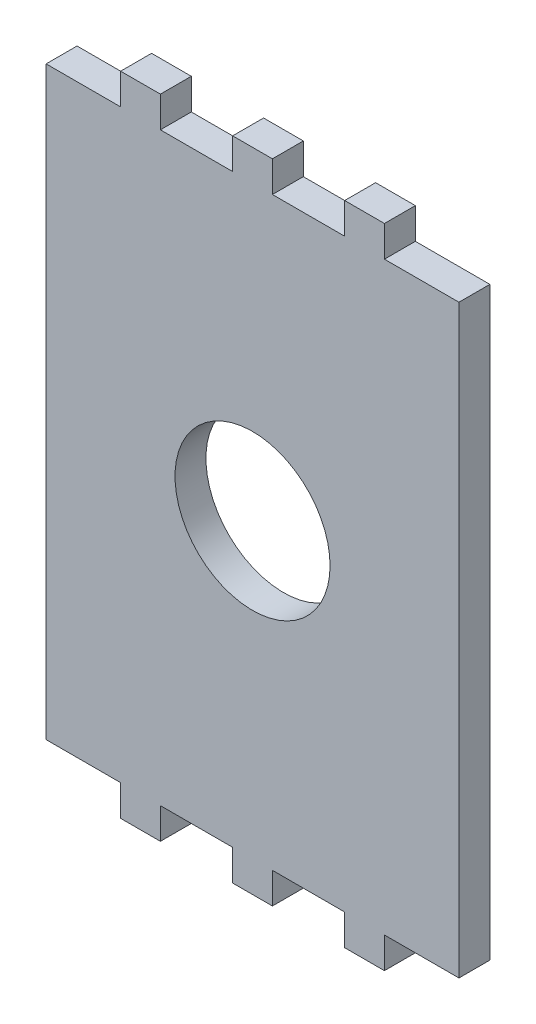
ISO-10303-21;
HEADER;
FILE_DESCRIPTION(('STEP AP214'),'2;1');
FILE_NAME('part.step','',(''),(''),'','','');
FILE_SCHEMA(('AUTOMOTIVE_DESIGN { 1 0 10303 214 1 1 1 1 }'));
ENDSEC;
DATA;
#1=APPLICATION_CONTEXT('core data for automotive mechanical design processes');
#2=APPLICATION_PROTOCOL_DEFINITION('international standard','automotive_design',2000,#1);
#3=PRODUCT_CONTEXT('',#1,'mechanical');
#4=PRODUCT('Part','Part','',(#3));
#5=PRODUCT_RELATED_PRODUCT_CATEGORY('part','',(#4));
#6=PRODUCT_DEFINITION_FORMATION('','',#4);
#7=PRODUCT_DEFINITION_CONTEXT('part definition',#1,'design');
#8=PRODUCT_DEFINITION('design','',#6,#7);
#9=PRODUCT_DEFINITION_SHAPE('','',#8);
#10=(LENGTH_UNIT() NAMED_UNIT(*) SI_UNIT(.MILLI.,.METRE.));
#11=(NAMED_UNIT(*) PLANE_ANGLE_UNIT() SI_UNIT($,.RADIAN.));
#12=(NAMED_UNIT(*) SI_UNIT($,.STERADIAN.) SOLID_ANGLE_UNIT());
#13=UNCERTAINTY_MEASURE_WITH_UNIT(LENGTH_MEASURE(1.E-05),#10,'distance_accuracy_value','');
#14=(GEOMETRIC_REPRESENTATION_CONTEXT(3) GLOBAL_UNCERTAINTY_ASSIGNED_CONTEXT((#13)) GLOBAL_UNIT_ASSIGNED_CONTEXT((#10,
#11,#12)) REPRESENTATION_CONTEXT('',''));
#15=CARTESIAN_POINT('',(0.,0.,0.));
#16=DIRECTION('',(0.,0.,1.));
#17=DIRECTION('',(1.,0.,0.));
#18=AXIS2_PLACEMENT_3D('',#15,#16,#17);
#19=CARTESIAN_POINT('',(0.,0.,0.));
#20=DIRECTION('',(0.,0.,1.));
#21=DIRECTION('',(1.,0.,0.));
#22=AXIS2_PLACEMENT_3D('',#19,#20,#21);
#23=CYLINDRICAL_SURFACE('',#22,7.95936);
#24=CARTESIAN_POINT('',(0.,0.,0.));
#25=DIRECTION('',(0.,0.,1.));
#26=DIRECTION('',(1.,0.,0.));
#27=AXIS2_PLACEMENT_3D('',#24,#25,#26);
#28=CIRCLE('',#27,7.95936);
#29=CARTESIAN_POINT('',(7.95936,0.,0.));
#30=VERTEX_POINT('',#29);
#31=EDGE_CURVE('E272',#30,#30,#28,.T.);
#32=ORIENTED_EDGE('',*,*,#31,.F.);
#33=EDGE_LOOP('',(#32));
#34=FACE_BOUND('',#33,.T.);
#35=CARTESIAN_POINT('',(0.,0.,3.175));
#36=DIRECTION('',(0.,0.,1.));
#37=DIRECTION('',(1.,0.,0.));
#38=AXIS2_PLACEMENT_3D('',#35,#36,#37);
#39=CIRCLE('',#38,7.95936);
#40=CARTESIAN_POINT('',(7.95936,0.,3.175));
#41=VERTEX_POINT('',#40);
#42=EDGE_CURVE('E474',#41,#41,#39,.T.);
#43=ORIENTED_EDGE('',*,*,#42,.T.);
#44=EDGE_LOOP('',(#43));
#45=FACE_BOUND('',#44,.T.);
#46=ADVANCED_FACE('F43',(#34,#45),#23,.F.);
#47=CARTESIAN_POINT('',(0.,0.,3.175));
#48=DIRECTION('',(0.,0.,1.));
#49=DIRECTION('',(1.,0.,0.));
#50=AXIS2_PLACEMENT_3D('',#47,#48,#49);
#51=PLANE('',#50);
#52=DIRECTION('',(1.,0.,0.));
#53=VECTOR('',#52,1.);
#54=CARTESIAN_POINT('',(13.54064,-30.04064,3.175));
#55=LINE('',#54,#53);
#56=CARTESIAN_POINT('',(13.54064,-30.04064,3.175));
#57=VERTEX_POINT('',#56);
#58=CARTESIAN_POINT('',(21.19064,-30.04064,3.175));
#59=VERTEX_POINT('',#58);
#60=EDGE_CURVE('E267',#57,#59,#55,.T.);
#61=ORIENTED_EDGE('',*,*,#60,.T.);
#62=DIRECTION('',(0.,1.,0.));
#63=VECTOR('',#62,1.);
#64=CARTESIAN_POINT('',(21.19064,-30.04064,3.175));
#65=LINE('',#64,#63);
#66=CARTESIAN_POINT('',(21.19064,30.04064,3.175));
#67=VERTEX_POINT('',#66);
#68=EDGE_CURVE('E271',#59,#67,#65,.T.);
#69=ORIENTED_EDGE('',*,*,#68,.T.);
#70=DIRECTION('',(-1.,0.,0.));
#71=VECTOR('',#70,1.);
#72=CARTESIAN_POINT('',(21.19064,30.04064,3.175));
#73=LINE('',#72,#71);
#74=CARTESIAN_POINT('',(13.54064,30.04064,3.175));
#75=VERTEX_POINT('',#74);
#76=EDGE_CURVE('E276',#67,#75,#73,.T.);
#77=ORIENTED_EDGE('',*,*,#76,.T.);
#78=DIRECTION('',(0.,1.,0.));
#79=VECTOR('',#78,1.);
#80=CARTESIAN_POINT('',(13.54064,30.04064,3.175));
#81=LINE('',#80,#79);
#82=CARTESIAN_POINT('',(13.54064,33.21564,3.175));
#83=VERTEX_POINT('',#82);
#84=EDGE_CURVE('E280',#75,#83,#81,.T.);
#85=ORIENTED_EDGE('',*,*,#84,.T.);
#86=DIRECTION('',(-1.,0.,0.));
#87=VECTOR('',#86,1.);
#88=CARTESIAN_POINT('',(13.54064,33.21564,3.175));
#89=LINE('',#88,#87);
#90=CARTESIAN_POINT('',(9.45935999999995,33.21564,3.175));
#91=VERTEX_POINT('',#90);
#92=EDGE_CURVE('E284',#83,#91,#89,.T.);
#93=ORIENTED_EDGE('',*,*,#92,.T.);
#94=DIRECTION('',(0.,-1.,0.));
#95=VECTOR('',#94,1.);
#96=CARTESIAN_POINT('',(9.45935999999995,33.21564,3.175));
#97=LINE('',#96,#95);
#98=CARTESIAN_POINT('',(9.45935999999995,30.04064,3.175));
#99=VERTEX_POINT('',#98);
#100=EDGE_CURVE('E288',#91,#99,#97,.T.);
#101=ORIENTED_EDGE('',*,*,#100,.T.);
#102=DIRECTION('',(-1.,0.,0.));
#103=VECTOR('',#102,1.);
#104=CARTESIAN_POINT('',(9.45935999999995,30.04064,3.175));
#105=LINE('',#104,#103);
#106=CARTESIAN_POINT('',(2.04063999999995,30.04064,3.175));
#107=VERTEX_POINT('',#106);
#108=EDGE_CURVE('E292',#99,#107,#105,.T.);
#109=ORIENTED_EDGE('',*,*,#108,.T.);
#110=DIRECTION('',(0.,1.,0.));
#111=VECTOR('',#110,1.);
#112=CARTESIAN_POINT('',(2.04063999999995,30.04064,3.175));
#113=LINE('',#112,#111);
#114=CARTESIAN_POINT('',(2.04063999999995,33.21564,3.175));
#115=VERTEX_POINT('',#114);
#116=EDGE_CURVE('E296',#107,#115,#113,.T.);
#117=ORIENTED_EDGE('',*,*,#116,.T.);
#118=DIRECTION('',(-1.,0.,0.));
#119=VECTOR('',#118,1.);
#120=CARTESIAN_POINT('',(2.04063999999995,33.21564,3.175));
#121=LINE('',#120,#119);
#122=CARTESIAN_POINT('',(-2.04064000000005,33.21564,3.175));
#123=VERTEX_POINT('',#122);
#124=EDGE_CURVE('E300',#115,#123,#121,.T.);
#125=ORIENTED_EDGE('',*,*,#124,.T.);
#126=DIRECTION('',(0.,-1.,0.));
#127=VECTOR('',#126,1.);
#128=CARTESIAN_POINT('',(-2.04064000000005,33.21564,3.175));
#129=LINE('',#128,#127);
#130=CARTESIAN_POINT('',(-2.04064000000005,30.04064,3.175));
#131=VERTEX_POINT('',#130);
#132=EDGE_CURVE('E304',#123,#131,#129,.T.);
#133=ORIENTED_EDGE('',*,*,#132,.T.);
#134=DIRECTION('',(-1.,0.,0.));
#135=VECTOR('',#134,1.);
#136=CARTESIAN_POINT('',(-2.04064000000005,30.04064,3.175));
#137=LINE('',#136,#135);
#138=CARTESIAN_POINT('',(-9.45936000000004,30.04064,3.175));
#139=VERTEX_POINT('',#138);
#140=EDGE_CURVE('E308',#131,#139,#137,.T.);
#141=ORIENTED_EDGE('',*,*,#140,.T.);
#142=DIRECTION('',(0.,1.,0.));
#143=VECTOR('',#142,1.);
#144=CARTESIAN_POINT('',(-9.45936000000004,30.04064,3.175));
#145=LINE('',#144,#143);
#146=CARTESIAN_POINT('',(-9.45936000000004,33.21564,3.175));
#147=VERTEX_POINT('',#146);
#148=EDGE_CURVE('E312',#139,#147,#145,.T.);
#149=ORIENTED_EDGE('',*,*,#148,.T.);
#150=DIRECTION('',(-1.,0.,0.));
#151=VECTOR('',#150,1.);
#152=CARTESIAN_POINT('',(-9.45936000000004,33.21564,3.175));
#153=LINE('',#152,#151);
#154=CARTESIAN_POINT('',(-13.5406400000001,33.21564,3.175));
#155=VERTEX_POINT('',#154);
#156=EDGE_CURVE('E316',#147,#155,#153,.T.);
#157=ORIENTED_EDGE('',*,*,#156,.T.);
#158=DIRECTION('',(0.,-1.,0.));
#159=VECTOR('',#158,1.);
#160=CARTESIAN_POINT('',(-13.5406400000001,33.21564,3.175));
#161=LINE('',#160,#159);
#162=CARTESIAN_POINT('',(-13.5406400000001,30.04064,3.175));
#163=VERTEX_POINT('',#162);
#164=EDGE_CURVE('E320',#155,#163,#161,.T.);
#165=ORIENTED_EDGE('',*,*,#164,.T.);
#166=DIRECTION('',(-1.,0.,0.));
#167=VECTOR('',#166,1.);
#168=CARTESIAN_POINT('',(-13.5406400000001,30.04064,3.175));
#169=LINE('',#168,#167);
#170=CARTESIAN_POINT('',(-21.19064,30.04064,3.175));
#171=VERTEX_POINT('',#170);
#172=EDGE_CURVE('E324',#163,#171,#169,.T.);
#173=ORIENTED_EDGE('',*,*,#172,.T.);
#174=DIRECTION('',(0.,-1.,0.));
#175=VECTOR('',#174,1.);
#176=CARTESIAN_POINT('',(-21.19064,30.04064,3.175));
#177=LINE('',#176,#175);
#178=CARTESIAN_POINT('',(-21.19064,-30.04064,3.175));
#179=VERTEX_POINT('',#178);
#180=EDGE_CURVE('E328',#171,#179,#177,.T.);
#181=ORIENTED_EDGE('',*,*,#180,.T.);
#182=DIRECTION('',(1.,0.,0.));
#183=VECTOR('',#182,1.);
#184=CARTESIAN_POINT('',(-21.19064,-30.04064,3.175));
#185=LINE('',#184,#183);
#186=CARTESIAN_POINT('',(-13.54064,-30.04064,3.175));
#187=VERTEX_POINT('',#186);
#188=EDGE_CURVE('E332',#179,#187,#185,.T.);
#189=ORIENTED_EDGE('',*,*,#188,.T.);
#190=DIRECTION('',(0.,-1.,0.));
#191=VECTOR('',#190,1.);
#192=CARTESIAN_POINT('',(-13.54064,-30.04064,3.175));
#193=LINE('',#192,#191);
#194=CARTESIAN_POINT('',(-13.54064,-33.21564,3.175));
#195=VERTEX_POINT('',#194);
#196=EDGE_CURVE('E336',#187,#195,#193,.T.);
#197=ORIENTED_EDGE('',*,*,#196,.T.);
#198=DIRECTION('',(1.,0.,0.));
#199=VECTOR('',#198,1.);
#200=CARTESIAN_POINT('',(-13.54064,-33.21564,3.175));
#201=LINE('',#200,#199);
#202=CARTESIAN_POINT('',(-9.45936000000004,-33.21564,3.175));
#203=VERTEX_POINT('',#202);
#204=EDGE_CURVE('E340',#195,#203,#201,.T.);
#205=ORIENTED_EDGE('',*,*,#204,.T.);
#206=DIRECTION('',(0.,1.,0.));
#207=VECTOR('',#206,1.);
#208=CARTESIAN_POINT('',(-9.45936000000004,-33.21564,3.175));
#209=LINE('',#208,#207);
#210=CARTESIAN_POINT('',(-9.45936000000004,-30.04064,3.175));
#211=VERTEX_POINT('',#210);
#212=EDGE_CURVE('E344',#203,#211,#209,.T.);
#213=ORIENTED_EDGE('',*,*,#212,.T.);
#214=DIRECTION('',(1.,0.,0.));
#215=VECTOR('',#214,1.);
#216=CARTESIAN_POINT('',(-9.45936000000004,-30.04064,3.175));
#217=LINE('',#216,#215);
#218=CARTESIAN_POINT('',(-2.04064000000005,-30.04064,3.175));
#219=VERTEX_POINT('',#218);
#220=EDGE_CURVE('E348',#211,#219,#217,.T.);
#221=ORIENTED_EDGE('',*,*,#220,.T.);
#222=DIRECTION('',(0.,-1.,0.));
#223=VECTOR('',#222,1.);
#224=CARTESIAN_POINT('',(-2.04064000000005,-30.04064,3.175));
#225=LINE('',#224,#223);
#226=CARTESIAN_POINT('',(-2.04064000000005,-33.21564,3.175));
#227=VERTEX_POINT('',#226);
#228=EDGE_CURVE('E352',#219,#227,#225,.T.);
#229=ORIENTED_EDGE('',*,*,#228,.T.);
#230=DIRECTION('',(1.,0.,0.));
#231=VECTOR('',#230,1.);
#232=CARTESIAN_POINT('',(-2.04064000000005,-33.21564,3.175));
#233=LINE('',#232,#231);
#234=CARTESIAN_POINT('',(2.04063999999995,-33.21564,3.175));
#235=VERTEX_POINT('',#234);
#236=EDGE_CURVE('E356',#227,#235,#233,.T.);
#237=ORIENTED_EDGE('',*,*,#236,.T.);
#238=DIRECTION('',(0.,1.,0.));
#239=VECTOR('',#238,1.);
#240=CARTESIAN_POINT('',(2.04063999999995,-33.21564,3.175));
#241=LINE('',#240,#239);
#242=CARTESIAN_POINT('',(2.04063999999995,-30.04064,3.175));
#243=VERTEX_POINT('',#242);
#244=EDGE_CURVE('E360',#235,#243,#241,.T.);
#245=ORIENTED_EDGE('',*,*,#244,.T.);
#246=DIRECTION('',(1.,0.,0.));
#247=VECTOR('',#246,1.);
#248=CARTESIAN_POINT('',(2.04063999999995,-30.04064,3.175));
#249=LINE('',#248,#247);
#250=CARTESIAN_POINT('',(9.45935999999995,-30.04064,3.175));
#251=VERTEX_POINT('',#250);
#252=EDGE_CURVE('E364',#243,#251,#249,.T.);
#253=ORIENTED_EDGE('',*,*,#252,.T.);
#254=DIRECTION('',(0.,-1.,0.));
#255=VECTOR('',#254,1.);
#256=CARTESIAN_POINT('',(9.45935999999995,-30.04064,3.175));
#257=LINE('',#256,#255);
#258=CARTESIAN_POINT('',(9.45935999999995,-33.21564,3.175));
#259=VERTEX_POINT('',#258);
#260=EDGE_CURVE('E368',#251,#259,#257,.T.);
#261=ORIENTED_EDGE('',*,*,#260,.T.);
#262=DIRECTION('',(1.,0.,0.));
#263=VECTOR('',#262,1.);
#264=CARTESIAN_POINT('',(9.45935999999995,-33.21564,3.175));
#265=LINE('',#264,#263);
#266=CARTESIAN_POINT('',(13.54064,-33.21564,3.175));
#267=VERTEX_POINT('',#266);
#268=EDGE_CURVE('E239',#259,#267,#265,.T.);
#269=ORIENTED_EDGE('',*,*,#268,.T.);
#270=DIRECTION('',(0.,1.,0.));
#271=VECTOR('',#270,1.);
#272=CARTESIAN_POINT('',(13.54064,-33.21564,3.175));
#273=LINE('',#272,#271);
#274=EDGE_CURVE('E373',#267,#57,#273,.T.);
#275=ORIENTED_EDGE('',*,*,#274,.T.);
#276=EDGE_LOOP('',(#61,#69,#77,#85,#93,#101,#109,#117,#125,#133,#141,#149,#157,#165,#173,#181,
#189,#197,#205,#213,#221,#229,#237,#245,#253,#261,#269,#275));
#277=FACE_BOUND('',#276,.T.);
#278=ORIENTED_EDGE('',*,*,#42,.F.);
#279=EDGE_LOOP('',(#278));
#280=FACE_BOUND('',#279,.T.);
#281=ADVANCED_FACE('F454',(#277,#280),#51,.T.);
#282=CARTESIAN_POINT('',(13.54064,-33.21564,0.));
#283=DIRECTION('',(1.,0.,0.));
#284=DIRECTION('',(0.,0.,-1.));
#285=AXIS2_PLACEMENT_3D('',#282,#283,#284);
#286=PLANE('',#285);
#287=ORIENTED_EDGE('',*,*,#274,.F.);
#288=DIRECTION('',(0.,0.,1.));
#289=VECTOR('',#288,1.);
#290=CARTESIAN_POINT('',(13.54064,-33.21564,0.));
#291=LINE('',#290,#289);
#292=CARTESIAN_POINT('',(13.54064,-33.21564,0.));
#293=VERTEX_POINT('',#292);
#294=EDGE_CURVE('E54',#293,#267,#291,.T.);
#295=ORIENTED_EDGE('',*,*,#294,.F.);
#296=DIRECTION('',(0.,1.,0.));
#297=VECTOR('',#296,1.);
#298=CARTESIAN_POINT('',(13.54064,-33.21564,0.));
#299=LINE('',#298,#297);
#300=CARTESIAN_POINT('',(13.54064,-30.04064,0.));
#301=VERTEX_POINT('',#300);
#302=EDGE_CURVE('E253',#293,#301,#299,.T.);
#303=ORIENTED_EDGE('',*,*,#302,.T.);
#304=DIRECTION('',(0.,0.,1.));
#305=VECTOR('',#304,1.);
#306=CARTESIAN_POINT('',(13.54064,-30.04064,0.));
#307=LINE('',#306,#305);
#308=EDGE_CURVE('E11',#301,#57,#307,.T.);
#309=ORIENTED_EDGE('',*,*,#308,.T.);
#310=EDGE_LOOP('',(#287,#295,#303,#309));
#311=FACE_BOUND('',#310,.T.);
#312=ADVANCED_FACE('F456',(#311),#286,.T.);
#313=CARTESIAN_POINT('',(9.45935999999995,-33.21564,0.));
#314=DIRECTION('',(0.,-1.,0.));
#315=DIRECTION('',(0.,0.,-1.));
#316=AXIS2_PLACEMENT_3D('',#313,#314,#315);
#317=PLANE('',#316);
#318=ORIENTED_EDGE('',*,*,#268,.F.);
#319=DIRECTION('',(0.,0.,1.));
#320=VECTOR('',#319,1.);
#321=CARTESIAN_POINT('',(9.45935999999995,-33.21564,0.));
#322=LINE('',#321,#320);
#323=CARTESIAN_POINT('',(9.45935999999995,-33.21564,0.));
#324=VERTEX_POINT('',#323);
#325=EDGE_CURVE('E234',#324,#259,#322,.T.);
#326=ORIENTED_EDGE('',*,*,#325,.F.);
#327=DIRECTION('',(1.,0.,0.));
#328=VECTOR('',#327,1.);
#329=CARTESIAN_POINT('',(9.45935999999995,-33.21564,0.));
#330=LINE('',#329,#328);
#331=EDGE_CURVE('E237',#324,#293,#330,.T.);
#332=ORIENTED_EDGE('',*,*,#331,.T.);
#333=ORIENTED_EDGE('',*,*,#294,.T.);
#334=EDGE_LOOP('',(#318,#326,#332,#333));
#335=FACE_BOUND('',#334,.T.);
#336=ADVANCED_FACE('F236',(#335),#317,.T.);
#337=CARTESIAN_POINT('',(9.45935999999995,-30.04064,0.));
#338=DIRECTION('',(-1.,0.,0.));
#339=DIRECTION('',(0.,0.,1.));
#340=AXIS2_PLACEMENT_3D('',#337,#338,#339);
#341=PLANE('',#340);
#342=ORIENTED_EDGE('',*,*,#260,.F.);
#343=DIRECTION('',(0.,0.,1.));
#344=VECTOR('',#343,1.);
#345=CARTESIAN_POINT('',(9.45935999999995,-30.04064,0.));
#346=LINE('',#345,#344);
#347=CARTESIAN_POINT('',(9.45935999999995,-30.04064,0.));
#348=VERTEX_POINT('',#347);
#349=EDGE_CURVE('E245',#348,#251,#346,.T.);
#350=ORIENTED_EDGE('',*,*,#349,.F.);
#351=DIRECTION('',(0.,-1.,0.));
#352=VECTOR('',#351,1.);
#353=CARTESIAN_POINT('',(9.45935999999995,-30.04064,0.));
#354=LINE('',#353,#352);
#355=EDGE_CURVE('E251',#348,#324,#354,.T.);
#356=ORIENTED_EDGE('',*,*,#355,.T.);
#357=ORIENTED_EDGE('',*,*,#325,.T.);
#358=EDGE_LOOP('',(#342,#350,#356,#357));
#359=FACE_BOUND('',#358,.T.);
#360=ADVANCED_FACE('F256',(#359),#341,.T.);
#361=CARTESIAN_POINT('',(2.04063999999995,-30.04064,0.));
#362=DIRECTION('',(0.,-1.,0.));
#363=DIRECTION('',(0.,0.,-1.));
#364=AXIS2_PLACEMENT_3D('',#361,#362,#363);
#365=PLANE('',#364);
#366=ORIENTED_EDGE('',*,*,#252,.F.);
#367=DIRECTION('',(0.,0.,1.));
#368=VECTOR('',#367,1.);
#369=CARTESIAN_POINT('',(2.04063999999995,-30.04064,0.));
#370=LINE('',#369,#368);
#371=CARTESIAN_POINT('',(2.04063999999995,-30.04064,0.));
#372=VERTEX_POINT('',#371);
#373=EDGE_CURVE('E382',#372,#243,#370,.T.);
#374=ORIENTED_EDGE('',*,*,#373,.F.);
#375=DIRECTION('',(1.,0.,0.));
#376=VECTOR('',#375,1.);
#377=CARTESIAN_POINT('',(2.04063999999995,-30.04064,0.));
#378=LINE('',#377,#376);
#379=EDGE_CURVE('E258',#372,#348,#378,.T.);
#380=ORIENTED_EDGE('',*,*,#379,.T.);
#381=ORIENTED_EDGE('',*,*,#349,.T.);
#382=EDGE_LOOP('',(#366,#374,#380,#381));
#383=FACE_BOUND('',#382,.T.);
#384=ADVANCED_FACE('F659',(#383),#365,.T.);
#385=CARTESIAN_POINT('',(2.04063999999995,-33.21564,0.));
#386=DIRECTION('',(1.,0.,0.));
#387=DIRECTION('',(0.,0.,-1.));
#388=AXIS2_PLACEMENT_3D('',#385,#386,#387);
#389=PLANE('',#388);
#390=ORIENTED_EDGE('',*,*,#244,.F.);
#391=DIRECTION('',(0.,0.,1.));
#392=VECTOR('',#391,1.);
#393=CARTESIAN_POINT('',(2.04063999999995,-33.21564,0.));
#394=LINE('',#393,#392);
#395=CARTESIAN_POINT('',(2.04063999999995,-33.21564,0.));
#396=VERTEX_POINT('',#395);
#397=EDGE_CURVE('E385',#396,#235,#394,.T.);
#398=ORIENTED_EDGE('',*,*,#397,.F.);
#399=DIRECTION('',(0.,1.,0.));
#400=VECTOR('',#399,1.);
#401=CARTESIAN_POINT('',(2.04063999999995,-33.21564,0.));
#402=LINE('',#401,#400);
#403=EDGE_CURVE('E261',#396,#372,#402,.T.);
#404=ORIENTED_EDGE('',*,*,#403,.T.);
#405=ORIENTED_EDGE('',*,*,#373,.T.);
#406=EDGE_LOOP('',(#390,#398,#404,#405));
#407=FACE_BOUND('',#406,.T.);
#408=ADVANCED_FACE('F573',(#407),#389,.T.);
#409=CARTESIAN_POINT('',(-2.04064000000005,-33.21564,0.));
#410=DIRECTION('',(0.,-1.,0.));
#411=DIRECTION('',(0.,0.,-1.));
#412=AXIS2_PLACEMENT_3D('',#409,#410,#411);
#413=PLANE('',#412);
#414=ORIENTED_EDGE('',*,*,#236,.F.);
#415=DIRECTION('',(0.,0.,1.));
#416=VECTOR('',#415,1.);
#417=CARTESIAN_POINT('',(-2.04064000000005,-33.21564,0.));
#418=LINE('',#417,#416);
#419=CARTESIAN_POINT('',(-2.04064000000005,-33.21564,0.));
#420=VERTEX_POINT('',#419);
#421=EDGE_CURVE('E388',#420,#227,#418,.T.);
#422=ORIENTED_EDGE('',*,*,#421,.F.);
#423=DIRECTION('',(1.,0.,0.));
#424=VECTOR('',#423,1.);
#425=CARTESIAN_POINT('',(-2.04064000000005,-33.21564,0.));
#426=LINE('',#425,#424);
#427=EDGE_CURVE('E565',#420,#396,#426,.T.);
#428=ORIENTED_EDGE('',*,*,#427,.T.);
#429=ORIENTED_EDGE('',*,*,#397,.T.);
#430=EDGE_LOOP('',(#414,#422,#428,#429));
#431=FACE_BOUND('',#430,.T.);
#432=ADVANCED_FACE('F579',(#431),#413,.T.);
#433=CARTESIAN_POINT('',(-2.04064000000005,-30.04064,0.));
#434=DIRECTION('',(-1.,0.,0.));
#435=DIRECTION('',(0.,0.,1.));
#436=AXIS2_PLACEMENT_3D('',#433,#434,#435);
#437=PLANE('',#436);
#438=ORIENTED_EDGE('',*,*,#228,.F.);
#439=DIRECTION('',(0.,0.,1.));
#440=VECTOR('',#439,1.);
#441=CARTESIAN_POINT('',(-2.04064000000005,-30.04064,0.));
#442=LINE('',#441,#440);
#443=CARTESIAN_POINT('',(-2.04064000000005,-30.04064,0.));
#444=VERTEX_POINT('',#443);
#445=EDGE_CURVE('E391',#444,#219,#442,.T.);
#446=ORIENTED_EDGE('',*,*,#445,.F.);
#447=DIRECTION('',(0.,-1.,0.));
#448=VECTOR('',#447,1.);
#449=CARTESIAN_POINT('',(-2.04064000000005,-30.04064,0.));
#450=LINE('',#449,#448);
#451=EDGE_CURVE('E561',#444,#420,#450,.T.);
#452=ORIENTED_EDGE('',*,*,#451,.T.);
#453=ORIENTED_EDGE('',*,*,#421,.T.);
#454=EDGE_LOOP('',(#438,#446,#452,#453));
#455=FACE_BOUND('',#454,.T.);
#456=ADVANCED_FACE('F582',(#455),#437,.T.);
#457=CARTESIAN_POINT('',(-9.45936000000004,-30.04064,0.));
#458=DIRECTION('',(0.,-1.,0.));
#459=DIRECTION('',(0.,0.,-1.));
#460=AXIS2_PLACEMENT_3D('',#457,#458,#459);
#461=PLANE('',#460);
#462=ORIENTED_EDGE('',*,*,#220,.F.);
#463=DIRECTION('',(0.,0.,1.));
#464=VECTOR('',#463,1.);
#465=CARTESIAN_POINT('',(-9.45936000000004,-30.04064,0.));
#466=LINE('',#465,#464);
#467=CARTESIAN_POINT('',(-9.45936000000004,-30.04064,0.));
#468=VERTEX_POINT('',#467);
#469=EDGE_CURVE('E394',#468,#211,#466,.T.);
#470=ORIENTED_EDGE('',*,*,#469,.F.);
#471=DIRECTION('',(1.,0.,0.));
#472=VECTOR('',#471,1.);
#473=CARTESIAN_POINT('',(-9.45936000000004,-30.04064,0.));
#474=LINE('',#473,#472);
#475=EDGE_CURVE('E557',#468,#444,#474,.T.);
#476=ORIENTED_EDGE('',*,*,#475,.T.);
#477=ORIENTED_EDGE('',*,*,#445,.T.);
#478=EDGE_LOOP('',(#462,#470,#476,#477));
#479=FACE_BOUND('',#478,.T.);
#480=ADVANCED_FACE('F587',(#479),#461,.T.);
#481=CARTESIAN_POINT('',(-9.45936000000004,-33.21564,0.));
#482=DIRECTION('',(1.,0.,0.));
#483=DIRECTION('',(0.,0.,-1.));
#484=AXIS2_PLACEMENT_3D('',#481,#482,#483);
#485=PLANE('',#484);
#486=ORIENTED_EDGE('',*,*,#212,.F.);
#487=DIRECTION('',(0.,0.,1.));
#488=VECTOR('',#487,1.);
#489=CARTESIAN_POINT('',(-9.45936000000004,-33.21564,0.));
#490=LINE('',#489,#488);
#491=CARTESIAN_POINT('',(-9.45936000000004,-33.21564,0.));
#492=VERTEX_POINT('',#491);
#493=EDGE_CURVE('E397',#492,#203,#490,.T.);
#494=ORIENTED_EDGE('',*,*,#493,.F.);
#495=DIRECTION('',(0.,1.,0.));
#496=VECTOR('',#495,1.);
#497=CARTESIAN_POINT('',(-9.45936000000004,-33.21564,0.));
#498=LINE('',#497,#496);
#499=EDGE_CURVE('E553',#492,#468,#498,.T.);
#500=ORIENTED_EDGE('',*,*,#499,.T.);
#501=ORIENTED_EDGE('',*,*,#469,.T.);
#502=EDGE_LOOP('',(#486,#494,#500,#501));
#503=FACE_BOUND('',#502,.T.);
#504=ADVANCED_FACE('F590',(#503),#485,.T.);
#505=CARTESIAN_POINT('',(-13.54064,-33.21564,0.));
#506=DIRECTION('',(0.,-1.,0.));
#507=DIRECTION('',(0.,0.,-1.));
#508=AXIS2_PLACEMENT_3D('',#505,#506,#507);
#509=PLANE('',#508);
#510=ORIENTED_EDGE('',*,*,#204,.F.);
#511=DIRECTION('',(0.,0.,1.));
#512=VECTOR('',#511,1.);
#513=CARTESIAN_POINT('',(-13.54064,-33.21564,0.));
#514=LINE('',#513,#512);
#515=CARTESIAN_POINT('',(-13.54064,-33.21564,0.));
#516=VERTEX_POINT('',#515);
#517=EDGE_CURVE('E400',#516,#195,#514,.T.);
#518=ORIENTED_EDGE('',*,*,#517,.F.);
#519=DIRECTION('',(1.,0.,0.));
#520=VECTOR('',#519,1.);
#521=CARTESIAN_POINT('',(-13.54064,-33.21564,0.));
#522=LINE('',#521,#520);
#523=EDGE_CURVE('E549',#516,#492,#522,.T.);
#524=ORIENTED_EDGE('',*,*,#523,.T.);
#525=ORIENTED_EDGE('',*,*,#493,.T.);
#526=EDGE_LOOP('',(#510,#518,#524,#525));
#527=FACE_BOUND('',#526,.T.);
#528=ADVANCED_FACE('F595',(#527),#509,.T.);
#529=CARTESIAN_POINT('',(-13.54064,-30.04064,0.));
#530=DIRECTION('',(-1.,0.,0.));
#531=DIRECTION('',(0.,-1.,0.));
#532=AXIS2_PLACEMENT_3D('',#529,#530,#531);
#533=PLANE('',#532);
#534=ORIENTED_EDGE('',*,*,#196,.F.);
#535=DIRECTION('',(0.,0.,1.));
#536=VECTOR('',#535,1.);
#537=CARTESIAN_POINT('',(-13.54064,-30.04064,0.));
#538=LINE('',#537,#536);
#539=CARTESIAN_POINT('',(-13.54064,-30.04064,0.));
#540=VERTEX_POINT('',#539);
#541=EDGE_CURVE('E403',#540,#187,#538,.T.);
#542=ORIENTED_EDGE('',*,*,#541,.F.);
#543=DIRECTION('',(0.,-1.,0.));
#544=VECTOR('',#543,1.);
#545=CARTESIAN_POINT('',(-13.54064,-30.04064,0.));
#546=LINE('',#545,#544);
#547=EDGE_CURVE('E545',#540,#516,#546,.T.);
#548=ORIENTED_EDGE('',*,*,#547,.T.);
#549=ORIENTED_EDGE('',*,*,#517,.T.);
#550=EDGE_LOOP('',(#534,#542,#548,#549));
#551=FACE_BOUND('',#550,.T.);
#552=ADVANCED_FACE('F598',(#551),#533,.T.);
#553=CARTESIAN_POINT('',(-21.19064,-30.04064,0.));
#554=DIRECTION('',(0.,-1.,0.));
#555=DIRECTION('',(0.,0.,-1.));
#556=AXIS2_PLACEMENT_3D('',#553,#554,#555);
#557=PLANE('',#556);
#558=ORIENTED_EDGE('',*,*,#188,.F.);
#559=DIRECTION('',(0.,0.,1.));
#560=VECTOR('',#559,1.);
#561=CARTESIAN_POINT('',(-21.19064,-30.04064,0.));
#562=LINE('',#561,#560);
#563=CARTESIAN_POINT('',(-21.19064,-30.04064,0.));
#564=VERTEX_POINT('',#563);
#565=EDGE_CURVE('E406',#564,#179,#562,.T.);
#566=ORIENTED_EDGE('',*,*,#565,.F.);
#567=DIRECTION('',(1.,0.,0.));
#568=VECTOR('',#567,1.);
#569=CARTESIAN_POINT('',(-21.19064,-30.04064,0.));
#570=LINE('',#569,#568);
#571=EDGE_CURVE('E541',#564,#540,#570,.T.);
#572=ORIENTED_EDGE('',*,*,#571,.T.);
#573=ORIENTED_EDGE('',*,*,#541,.T.);
#574=EDGE_LOOP('',(#558,#566,#572,#573));
#575=FACE_BOUND('',#574,.T.);
#576=ADVANCED_FACE('F603',(#575),#557,.T.);
#577=CARTESIAN_POINT('',(-21.19064,30.04064,0.));
#578=DIRECTION('',(-1.,0.,0.));
#579=DIRECTION('',(0.,0.,1.));
#580=AXIS2_PLACEMENT_3D('',#577,#578,#579);
#581=PLANE('',#580);
#582=ORIENTED_EDGE('',*,*,#180,.F.);
#583=DIRECTION('',(0.,0.,1.));
#584=VECTOR('',#583,1.);
#585=CARTESIAN_POINT('',(-21.19064,30.04064,0.));
#586=LINE('',#585,#584);
#587=CARTESIAN_POINT('',(-21.19064,30.04064,0.));
#588=VERTEX_POINT('',#587);
#589=EDGE_CURVE('E409',#588,#171,#586,.T.);
#590=ORIENTED_EDGE('',*,*,#589,.F.);
#591=DIRECTION('',(0.,-1.,0.));
#592=VECTOR('',#591,1.);
#593=CARTESIAN_POINT('',(-21.19064,30.04064,0.));
#594=LINE('',#593,#592);
#595=EDGE_CURVE('E537',#588,#564,#594,.T.);
#596=ORIENTED_EDGE('',*,*,#595,.T.);
#597=ORIENTED_EDGE('',*,*,#565,.T.);
#598=EDGE_LOOP('',(#582,#590,#596,#597));
#599=FACE_BOUND('',#598,.T.);
#600=ADVANCED_FACE('F606',(#599),#581,.T.);
#601=CARTESIAN_POINT('',(-13.5406400000001,30.04064,0.));
#602=DIRECTION('',(0.,1.,0.));
#603=DIRECTION('',(0.,0.,1.));
#604=AXIS2_PLACEMENT_3D('',#601,#602,#603);
#605=PLANE('',#604);
#606=ORIENTED_EDGE('',*,*,#172,.F.);
#607=DIRECTION('',(0.,0.,1.));
#608=VECTOR('',#607,1.);
#609=CARTESIAN_POINT('',(-13.5406400000001,30.04064,0.));
#610=LINE('',#609,#608);
#611=CARTESIAN_POINT('',(-13.5406400000001,30.04064,0.));
#612=VERTEX_POINT('',#611);
#613=EDGE_CURVE('E412',#612,#163,#610,.T.);
#614=ORIENTED_EDGE('',*,*,#613,.F.);
#615=DIRECTION('',(-1.,0.,0.));
#616=VECTOR('',#615,1.);
#617=CARTESIAN_POINT('',(-13.5406400000001,30.04064,0.));
#618=LINE('',#617,#616);
#619=EDGE_CURVE('E533',#612,#588,#618,.T.);
#620=ORIENTED_EDGE('',*,*,#619,.T.);
#621=ORIENTED_EDGE('',*,*,#589,.T.);
#622=EDGE_LOOP('',(#606,#614,#620,#621));
#623=FACE_BOUND('',#622,.T.);
#624=ADVANCED_FACE('F611',(#623),#605,.T.);
#625=CARTESIAN_POINT('',(-13.5406400000001,33.21564,0.));
#626=DIRECTION('',(-1.,0.,0.));
#627=DIRECTION('',(0.,-1.,0.));
#628=AXIS2_PLACEMENT_3D('',#625,#626,#627);
#629=PLANE('',#628);
#630=ORIENTED_EDGE('',*,*,#164,.F.);
#631=DIRECTION('',(0.,0.,1.));
#632=VECTOR('',#631,1.);
#633=CARTESIAN_POINT('',(-13.5406400000001,33.21564,0.));
#634=LINE('',#633,#632);
#635=CARTESIAN_POINT('',(-13.5406400000001,33.21564,0.));
#636=VERTEX_POINT('',#635);
#637=EDGE_CURVE('E415',#636,#155,#634,.T.);
#638=ORIENTED_EDGE('',*,*,#637,.F.);
#639=DIRECTION('',(0.,-1.,0.));
#640=VECTOR('',#639,1.);
#641=CARTESIAN_POINT('',(-13.5406400000001,33.21564,0.));
#642=LINE('',#641,#640);
#643=EDGE_CURVE('E529',#636,#612,#642,.T.);
#644=ORIENTED_EDGE('',*,*,#643,.T.);
#645=ORIENTED_EDGE('',*,*,#613,.T.);
#646=EDGE_LOOP('',(#630,#638,#644,#645));
#647=FACE_BOUND('',#646,.T.);
#648=ADVANCED_FACE('F614',(#647),#629,.T.);
#649=CARTESIAN_POINT('',(-9.45936000000004,33.21564,0.));
#650=DIRECTION('',(0.,1.,0.));
#651=DIRECTION('',(-1.,0.,0.));
#652=AXIS2_PLACEMENT_3D('',#649,#650,#651);
#653=PLANE('',#652);
#654=ORIENTED_EDGE('',*,*,#156,.F.);
#655=DIRECTION('',(0.,0.,1.));
#656=VECTOR('',#655,1.);
#657=CARTESIAN_POINT('',(-9.45936000000004,33.21564,0.));
#658=LINE('',#657,#656);
#659=CARTESIAN_POINT('',(-9.45936000000004,33.21564,0.));
#660=VERTEX_POINT('',#659);
#661=EDGE_CURVE('E418',#660,#147,#658,.T.);
#662=ORIENTED_EDGE('',*,*,#661,.F.);
#663=DIRECTION('',(-1.,0.,0.));
#664=VECTOR('',#663,1.);
#665=CARTESIAN_POINT('',(-9.45936000000004,33.21564,0.));
#666=LINE('',#665,#664);
#667=EDGE_CURVE('E525',#660,#636,#666,.T.);
#668=ORIENTED_EDGE('',*,*,#667,.T.);
#669=ORIENTED_EDGE('',*,*,#637,.T.);
#670=EDGE_LOOP('',(#654,#662,#668,#669));
#671=FACE_BOUND('',#670,.T.);
#672=ADVANCED_FACE('F619',(#671),#653,.T.);
#673=CARTESIAN_POINT('',(-9.45936000000004,30.04064,0.));
#674=DIRECTION('',(1.,0.,0.));
#675=DIRECTION('',(0.,0.,-1.));
#676=AXIS2_PLACEMENT_3D('',#673,#674,#675);
#677=PLANE('',#676);
#678=ORIENTED_EDGE('',*,*,#148,.F.);
#679=DIRECTION('',(0.,0.,1.));
#680=VECTOR('',#679,1.);
#681=CARTESIAN_POINT('',(-9.45936000000004,30.04064,0.));
#682=LINE('',#681,#680);
#683=CARTESIAN_POINT('',(-9.45936000000004,30.04064,0.));
#684=VERTEX_POINT('',#683);
#685=EDGE_CURVE('E421',#684,#139,#682,.T.);
#686=ORIENTED_EDGE('',*,*,#685,.F.);
#687=DIRECTION('',(0.,1.,0.));
#688=VECTOR('',#687,1.);
#689=CARTESIAN_POINT('',(-9.45936000000004,30.04064,0.));
#690=LINE('',#689,#688);
#691=EDGE_CURVE('E521',#684,#660,#690,.T.);
#692=ORIENTED_EDGE('',*,*,#691,.T.);
#693=ORIENTED_EDGE('',*,*,#661,.T.);
#694=EDGE_LOOP('',(#678,#686,#692,#693));
#695=FACE_BOUND('',#694,.T.);
#696=ADVANCED_FACE('F622',(#695),#677,.T.);
#697=CARTESIAN_POINT('',(-2.04064000000005,30.04064,0.));
#698=DIRECTION('',(0.,1.,0.));
#699=DIRECTION('',(0.,0.,1.));
#700=AXIS2_PLACEMENT_3D('',#697,#698,#699);
#701=PLANE('',#700);
#702=ORIENTED_EDGE('',*,*,#140,.F.);
#703=DIRECTION('',(0.,0.,1.));
#704=VECTOR('',#703,1.);
#705=CARTESIAN_POINT('',(-2.04064000000005,30.04064,0.));
#706=LINE('',#705,#704);
#707=CARTESIAN_POINT('',(-2.04064000000005,30.04064,0.));
#708=VERTEX_POINT('',#707);
#709=EDGE_CURVE('E424',#708,#131,#706,.T.);
#710=ORIENTED_EDGE('',*,*,#709,.F.);
#711=DIRECTION('',(-1.,0.,0.));
#712=VECTOR('',#711,1.);
#713=CARTESIAN_POINT('',(-2.04064000000005,30.04064,0.));
#714=LINE('',#713,#712);
#715=EDGE_CURVE('E517',#708,#684,#714,.T.);
#716=ORIENTED_EDGE('',*,*,#715,.T.);
#717=ORIENTED_EDGE('',*,*,#685,.T.);
#718=EDGE_LOOP('',(#702,#710,#716,#717));
#719=FACE_BOUND('',#718,.T.);
#720=ADVANCED_FACE('F627',(#719),#701,.T.);
#721=CARTESIAN_POINT('',(-2.04064000000005,33.21564,0.));
#722=DIRECTION('',(-1.,0.,0.));
#723=DIRECTION('',(0.,0.,1.));
#724=AXIS2_PLACEMENT_3D('',#721,#722,#723);
#725=PLANE('',#724);
#726=ORIENTED_EDGE('',*,*,#132,.F.);
#727=DIRECTION('',(0.,0.,1.));
#728=VECTOR('',#727,1.);
#729=CARTESIAN_POINT('',(-2.04064000000005,33.21564,0.));
#730=LINE('',#729,#728);
#731=CARTESIAN_POINT('',(-2.04064000000005,33.21564,0.));
#732=VERTEX_POINT('',#731);
#733=EDGE_CURVE('E427',#732,#123,#730,.T.);
#734=ORIENTED_EDGE('',*,*,#733,.F.);
#735=DIRECTION('',(0.,-1.,0.));
#736=VECTOR('',#735,1.);
#737=CARTESIAN_POINT('',(-2.04064000000005,33.21564,0.));
#738=LINE('',#737,#736);
#739=EDGE_CURVE('E513',#732,#708,#738,.T.);
#740=ORIENTED_EDGE('',*,*,#739,.T.);
#741=ORIENTED_EDGE('',*,*,#709,.T.);
#742=EDGE_LOOP('',(#726,#734,#740,#741));
#743=FACE_BOUND('',#742,.T.);
#744=ADVANCED_FACE('F630',(#743),#725,.T.);
#745=CARTESIAN_POINT('',(2.04063999999995,33.21564,0.));
#746=DIRECTION('',(0.,1.,0.));
#747=DIRECTION('',(0.,0.,1.));
#748=AXIS2_PLACEMENT_3D('',#745,#746,#747);
#749=PLANE('',#748);
#750=ORIENTED_EDGE('',*,*,#124,.F.);
#751=DIRECTION('',(0.,0.,1.));
#752=VECTOR('',#751,1.);
#753=CARTESIAN_POINT('',(2.04063999999995,33.21564,0.));
#754=LINE('',#753,#752);
#755=CARTESIAN_POINT('',(2.04063999999995,33.21564,0.));
#756=VERTEX_POINT('',#755);
#757=EDGE_CURVE('E430',#756,#115,#754,.T.);
#758=ORIENTED_EDGE('',*,*,#757,.F.);
#759=DIRECTION('',(-1.,0.,0.));
#760=VECTOR('',#759,1.);
#761=CARTESIAN_POINT('',(2.04063999999995,33.21564,0.));
#762=LINE('',#761,#760);
#763=EDGE_CURVE('E509',#756,#732,#762,.T.);
#764=ORIENTED_EDGE('',*,*,#763,.T.);
#765=ORIENTED_EDGE('',*,*,#733,.T.);
#766=EDGE_LOOP('',(#750,#758,#764,#765));
#767=FACE_BOUND('',#766,.T.);
#768=ADVANCED_FACE('F635',(#767),#749,.T.);
#769=CARTESIAN_POINT('',(2.04063999999995,30.04064,0.));
#770=DIRECTION('',(1.,0.,0.));
#771=DIRECTION('',(0.,0.,-1.));
#772=AXIS2_PLACEMENT_3D('',#769,#770,#771);
#773=PLANE('',#772);
#774=ORIENTED_EDGE('',*,*,#116,.F.);
#775=DIRECTION('',(0.,0.,1.));
#776=VECTOR('',#775,1.);
#777=CARTESIAN_POINT('',(2.04063999999995,30.04064,0.));
#778=LINE('',#777,#776);
#779=CARTESIAN_POINT('',(2.04063999999995,30.04064,0.));
#780=VERTEX_POINT('',#779);
#781=EDGE_CURVE('E433',#780,#107,#778,.T.);
#782=ORIENTED_EDGE('',*,*,#781,.F.);
#783=DIRECTION('',(0.,1.,0.));
#784=VECTOR('',#783,1.);
#785=CARTESIAN_POINT('',(2.04063999999995,30.04064,0.));
#786=LINE('',#785,#784);
#787=EDGE_CURVE('E505',#780,#756,#786,.T.);
#788=ORIENTED_EDGE('',*,*,#787,.T.);
#789=ORIENTED_EDGE('',*,*,#757,.T.);
#790=EDGE_LOOP('',(#774,#782,#788,#789));
#791=FACE_BOUND('',#790,.T.);
#792=ADVANCED_FACE('F638',(#791),#773,.T.);
#793=CARTESIAN_POINT('',(9.45935999999995,30.04064,0.));
#794=DIRECTION('',(0.,1.,0.));
#795=DIRECTION('',(0.,0.,1.));
#796=AXIS2_PLACEMENT_3D('',#793,#794,#795);
#797=PLANE('',#796);
#798=ORIENTED_EDGE('',*,*,#108,.F.);
#799=DIRECTION('',(0.,0.,1.));
#800=VECTOR('',#799,1.);
#801=CARTESIAN_POINT('',(9.45935999999995,30.04064,0.));
#802=LINE('',#801,#800);
#803=CARTESIAN_POINT('',(9.45935999999995,30.04064,0.));
#804=VERTEX_POINT('',#803);
#805=EDGE_CURVE('E436',#804,#99,#802,.T.);
#806=ORIENTED_EDGE('',*,*,#805,.F.);
#807=DIRECTION('',(-1.,0.,0.));
#808=VECTOR('',#807,1.);
#809=CARTESIAN_POINT('',(9.45935999999995,30.04064,0.));
#810=LINE('',#809,#808);
#811=EDGE_CURVE('E501',#804,#780,#810,.T.);
#812=ORIENTED_EDGE('',*,*,#811,.T.);
#813=ORIENTED_EDGE('',*,*,#781,.T.);
#814=EDGE_LOOP('',(#798,#806,#812,#813));
#815=FACE_BOUND('',#814,.T.);
#816=ADVANCED_FACE('F643',(#815),#797,.T.);
#817=CARTESIAN_POINT('',(9.45935999999995,33.21564,0.));
#818=DIRECTION('',(-1.,0.,0.));
#819=DIRECTION('',(0.,0.,1.));
#820=AXIS2_PLACEMENT_3D('',#817,#818,#819);
#821=PLANE('',#820);
#822=ORIENTED_EDGE('',*,*,#100,.F.);
#823=DIRECTION('',(0.,0.,1.));
#824=VECTOR('',#823,1.);
#825=CARTESIAN_POINT('',(9.45935999999995,33.21564,0.));
#826=LINE('',#825,#824);
#827=CARTESIAN_POINT('',(9.45935999999995,33.21564,0.));
#828=VERTEX_POINT('',#827);
#829=EDGE_CURVE('E439',#828,#91,#826,.T.);
#830=ORIENTED_EDGE('',*,*,#829,.F.);
#831=DIRECTION('',(0.,-1.,0.));
#832=VECTOR('',#831,1.);
#833=CARTESIAN_POINT('',(9.45935999999995,33.21564,0.));
#834=LINE('',#833,#832);
#835=EDGE_CURVE('E497',#828,#804,#834,.T.);
#836=ORIENTED_EDGE('',*,*,#835,.T.);
#837=ORIENTED_EDGE('',*,*,#805,.T.);
#838=EDGE_LOOP('',(#822,#830,#836,#837));
#839=FACE_BOUND('',#838,.T.);
#840=ADVANCED_FACE('F646',(#839),#821,.T.);
#841=CARTESIAN_POINT('',(13.54064,33.21564,0.));
#842=DIRECTION('',(0.,1.,0.));
#843=DIRECTION('',(0.,0.,1.));
#844=AXIS2_PLACEMENT_3D('',#841,#842,#843);
#845=PLANE('',#844);
#846=ORIENTED_EDGE('',*,*,#92,.F.);
#847=DIRECTION('',(0.,0.,1.));
#848=VECTOR('',#847,1.);
#849=CARTESIAN_POINT('',(13.54064,33.21564,0.));
#850=LINE('',#849,#848);
#851=CARTESIAN_POINT('',(13.54064,33.21564,0.));
#852=VERTEX_POINT('',#851);
#853=EDGE_CURVE('E442',#852,#83,#850,.T.);
#854=ORIENTED_EDGE('',*,*,#853,.F.);
#855=DIRECTION('',(-1.,0.,0.));
#856=VECTOR('',#855,1.);
#857=CARTESIAN_POINT('',(13.54064,33.21564,0.));
#858=LINE('',#857,#856);
#859=EDGE_CURVE('E493',#852,#828,#858,.T.);
#860=ORIENTED_EDGE('',*,*,#859,.T.);
#861=ORIENTED_EDGE('',*,*,#829,.T.);
#862=EDGE_LOOP('',(#846,#854,#860,#861));
#863=FACE_BOUND('',#862,.T.);
#864=ADVANCED_FACE('F651',(#863),#845,.T.);
#865=CARTESIAN_POINT('',(13.54064,30.04064,0.));
#866=DIRECTION('',(1.,0.,0.));
#867=DIRECTION('',(0.,0.,-1.));
#868=AXIS2_PLACEMENT_3D('',#865,#866,#867);
#869=PLANE('',#868);
#870=ORIENTED_EDGE('',*,*,#84,.F.);
#871=DIRECTION('',(0.,0.,1.));
#872=VECTOR('',#871,1.);
#873=CARTESIAN_POINT('',(13.54064,30.04064,0.));
#874=LINE('',#873,#872);
#875=CARTESIAN_POINT('',(13.54064,30.04064,0.));
#876=VERTEX_POINT('',#875);
#877=EDGE_CURVE('E445',#876,#75,#874,.T.);
#878=ORIENTED_EDGE('',*,*,#877,.F.);
#879=DIRECTION('',(0.,1.,0.));
#880=VECTOR('',#879,1.);
#881=CARTESIAN_POINT('',(13.54064,30.04064,0.));
#882=LINE('',#881,#880);
#883=EDGE_CURVE('E489',#876,#852,#882,.T.);
#884=ORIENTED_EDGE('',*,*,#883,.T.);
#885=ORIENTED_EDGE('',*,*,#853,.T.);
#886=EDGE_LOOP('',(#870,#878,#884,#885));
#887=FACE_BOUND('',#886,.T.);
#888=ADVANCED_FACE('F654',(#887),#869,.T.);
#889=CARTESIAN_POINT('',(21.19064,30.04064,0.));
#890=DIRECTION('',(0.,1.,0.));
#891=DIRECTION('',(0.,0.,1.));
#892=AXIS2_PLACEMENT_3D('',#889,#890,#891);
#893=PLANE('',#892);
#894=ORIENTED_EDGE('',*,*,#76,.F.);
#895=DIRECTION('',(0.,0.,1.));
#896=VECTOR('',#895,1.);
#897=CARTESIAN_POINT('',(21.19064,30.04064,0.));
#898=LINE('',#897,#896);
#899=CARTESIAN_POINT('',(21.19064,30.04064,0.));
#900=VERTEX_POINT('',#899);
#901=EDGE_CURVE('E447',#900,#67,#898,.T.);
#902=ORIENTED_EDGE('',*,*,#901,.F.);
#903=DIRECTION('',(-1.,0.,0.));
#904=VECTOR('',#903,1.);
#905=CARTESIAN_POINT('',(21.19064,30.04064,0.));
#906=LINE('',#905,#904);
#907=EDGE_CURVE('E485',#900,#876,#906,.T.);
#908=ORIENTED_EDGE('',*,*,#907,.T.);
#909=ORIENTED_EDGE('',*,*,#877,.T.);
#910=EDGE_LOOP('',(#894,#902,#908,#909));
#911=FACE_BOUND('',#910,.T.);
#912=ADVANCED_FACE('F657',(#911),#893,.T.);
#913=CARTESIAN_POINT('',(21.19064,-30.04064,0.));
#914=DIRECTION('',(1.,0.,0.));
#915=DIRECTION('',(0.,0.,-1.));
#916=AXIS2_PLACEMENT_3D('',#913,#914,#915);
#917=PLANE('',#916);
#918=ORIENTED_EDGE('',*,*,#68,.F.);
#919=DIRECTION('',(0.,0.,1.));
#920=VECTOR('',#919,1.);
#921=CARTESIAN_POINT('',(21.19064,-30.04064,0.));
#922=LINE('',#921,#920);
#923=CARTESIAN_POINT('',(21.19064,-30.04064,0.));
#924=VERTEX_POINT('',#923);
#925=EDGE_CURVE('E47',#924,#59,#922,.T.);
#926=ORIENTED_EDGE('',*,*,#925,.F.);
#927=DIRECTION('',(0.,1.,0.));
#928=VECTOR('',#927,1.);
#929=CARTESIAN_POINT('',(21.19064,-30.04064,0.));
#930=LINE('',#929,#928);
#931=EDGE_CURVE('E482',#924,#900,#930,.T.);
#932=ORIENTED_EDGE('',*,*,#931,.T.);
#933=ORIENTED_EDGE('',*,*,#901,.T.);
#934=EDGE_LOOP('',(#918,#926,#932,#933));
#935=FACE_BOUND('',#934,.T.);
#936=ADVANCED_FACE('F452',(#935),#917,.T.);
#937=CARTESIAN_POINT('',(13.54064,-30.04064,0.));
#938=DIRECTION('',(0.,-1.,0.));
#939=DIRECTION('',(0.,0.,-1.));
#940=AXIS2_PLACEMENT_3D('',#937,#938,#939);
#941=PLANE('',#940);
#942=ORIENTED_EDGE('',*,*,#60,.F.);
#943=ORIENTED_EDGE('',*,*,#308,.F.);
#944=DIRECTION('',(1.,0.,0.));
#945=VECTOR('',#944,1.);
#946=CARTESIAN_POINT('',(13.54064,-30.04064,0.));
#947=LINE('',#946,#945);
#948=EDGE_CURVE('E376',#301,#924,#947,.T.);
#949=ORIENTED_EDGE('',*,*,#948,.T.);
#950=ORIENTED_EDGE('',*,*,#925,.T.);
#951=EDGE_LOOP('',(#942,#943,#949,#950));
#952=FACE_BOUND('',#951,.T.);
#953=ADVANCED_FACE('F451',(#952),#941,.T.);
#954=CARTESIAN_POINT('',(0.,0.,0.));
#955=DIRECTION('',(0.,0.,1.));
#956=DIRECTION('',(1.,0.,0.));
#957=AXIS2_PLACEMENT_3D('',#954,#955,#956);
#958=PLANE('',#957);
#959=ORIENTED_EDGE('',*,*,#948,.F.);
#960=ORIENTED_EDGE('',*,*,#302,.F.);
#961=ORIENTED_EDGE('',*,*,#331,.F.);
#962=ORIENTED_EDGE('',*,*,#355,.F.);
#963=ORIENTED_EDGE('',*,*,#379,.F.);
#964=ORIENTED_EDGE('',*,*,#403,.F.);
#965=ORIENTED_EDGE('',*,*,#427,.F.);
#966=ORIENTED_EDGE('',*,*,#451,.F.);
#967=ORIENTED_EDGE('',*,*,#475,.F.);
#968=ORIENTED_EDGE('',*,*,#499,.F.);
#969=ORIENTED_EDGE('',*,*,#523,.F.);
#970=ORIENTED_EDGE('',*,*,#547,.F.);
#971=ORIENTED_EDGE('',*,*,#571,.F.);
#972=ORIENTED_EDGE('',*,*,#595,.F.);
#973=ORIENTED_EDGE('',*,*,#619,.F.);
#974=ORIENTED_EDGE('',*,*,#643,.F.);
#975=ORIENTED_EDGE('',*,*,#667,.F.);
#976=ORIENTED_EDGE('',*,*,#691,.F.);
#977=ORIENTED_EDGE('',*,*,#715,.F.);
#978=ORIENTED_EDGE('',*,*,#739,.F.);
#979=ORIENTED_EDGE('',*,*,#763,.F.);
#980=ORIENTED_EDGE('',*,*,#787,.F.);
#981=ORIENTED_EDGE('',*,*,#811,.F.);
#982=ORIENTED_EDGE('',*,*,#835,.F.);
#983=ORIENTED_EDGE('',*,*,#859,.F.);
#984=ORIENTED_EDGE('',*,*,#883,.F.);
#985=ORIENTED_EDGE('',*,*,#907,.F.);
#986=ORIENTED_EDGE('',*,*,#931,.F.);
#987=EDGE_LOOP('',(#959,#960,#961,#962,#963,#964,#965,#966,#967,#968,#969,#970,#971,#972,#973,
#974,#975,#976,#977,#978,#979,#980,#981,#982,#983,#984,#985,#986));
#988=FACE_BOUND('',#987,.T.);
#989=ORIENTED_EDGE('',*,*,#31,.T.);
#990=EDGE_LOOP('',(#989));
#991=FACE_BOUND('',#990,.T.);
#992=ADVANCED_FACE('F45',(#988,#991),#958,.F.);
#993=CLOSED_SHELL('',(#46,#281,#312,#336,#360,#384,#408,#432,#456,#480,#504,#528,#552,#576,#600,
#624,#648,#672,#696,#720,#744,#768,#792,#816,#840,#864,#888,#912,#936,#953,#992));
#994=MANIFOLD_SOLID_BREP('B2',#993);
#995=ADVANCED_BREP_SHAPE_REPRESENTATION('',(#18,#994),#14);
#996=SHAPE_DEFINITION_REPRESENTATION(#9,#995);
ENDSEC;
END-ISO-10303-21;
